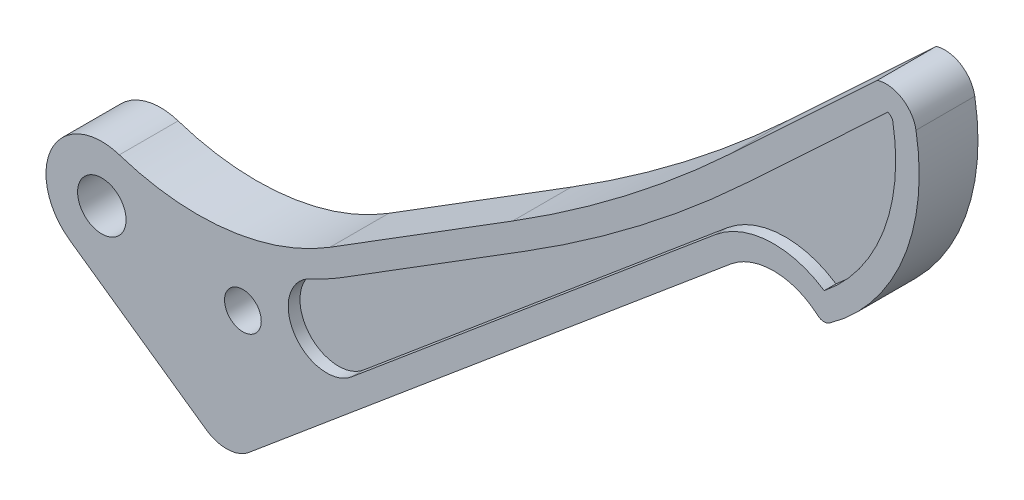
ISO-10303-21;
HEADER;
FILE_DESCRIPTION(('STEP AP214'),'2;1');
FILE_NAME('part.step','',(''),(''),'','','');
FILE_SCHEMA(('AUTOMOTIVE_DESIGN { 1 0 10303 214 1 1 1 1 }'));
ENDSEC;
DATA;
#1=APPLICATION_CONTEXT('core data for automotive mechanical design processes');
#2=APPLICATION_PROTOCOL_DEFINITION('international standard','automotive_design',2000,#1);
#3=PRODUCT_CONTEXT('',#1,'mechanical');
#4=PRODUCT('Part','Part','',(#3));
#5=PRODUCT_RELATED_PRODUCT_CATEGORY('part','',(#4));
#6=PRODUCT_DEFINITION_FORMATION('','',#4);
#7=PRODUCT_DEFINITION_CONTEXT('part definition',#1,'design');
#8=PRODUCT_DEFINITION('design','',#6,#7);
#9=PRODUCT_DEFINITION_SHAPE('','',#8);
#10=(LENGTH_UNIT() NAMED_UNIT(*) SI_UNIT(.MILLI.,.METRE.));
#11=(NAMED_UNIT(*) PLANE_ANGLE_UNIT() SI_UNIT($,.RADIAN.));
#12=(NAMED_UNIT(*) SI_UNIT($,.STERADIAN.) SOLID_ANGLE_UNIT());
#13=UNCERTAINTY_MEASURE_WITH_UNIT(LENGTH_MEASURE(1.E-05),#10,'distance_accuracy_value','');
#14=(GEOMETRIC_REPRESENTATION_CONTEXT(3) GLOBAL_UNCERTAINTY_ASSIGNED_CONTEXT((#13)) GLOBAL_UNIT_ASSIGNED_CONTEXT((#10,
#11,#12)) REPRESENTATION_CONTEXT('',''));
#15=CARTESIAN_POINT('',(0.,0.,0.));
#16=DIRECTION('',(0.,0.,1.));
#17=DIRECTION('',(1.,0.,0.));
#18=AXIS2_PLACEMENT_3D('',#15,#16,#17);
#19=CARTESIAN_POINT('',(0.,0.,0.));
#20=DIRECTION('',(0.,0.,1.));
#21=DIRECTION('',(1.,0.,0.));
#22=AXIS2_PLACEMENT_3D('',#19,#20,#21);
#23=PLANE('',#22);
#24=CARTESIAN_POINT('',(0.,0.,0.));
#25=DIRECTION('',(0.,0.,1.));
#26=DIRECTION('',(1.,0.,0.));
#27=AXIS2_PLACEMENT_3D('',#24,#25,#26);
#28=CIRCLE('',#27,6.5484375);
#29=CARTESIAN_POINT('',(6.5484375,0.,0.));
#30=VERTEX_POINT('',#29);
#31=EDGE_CURVE('E356',#30,#30,#28,.T.);
#32=ORIENTED_EDGE('',*,*,#31,.T.);
#33=EDGE_LOOP('',(#32));
#34=FACE_BOUND('',#33,.T.);
#35=CARTESIAN_POINT('',(38.1,-5.43168266689182,0.));
#36=DIRECTION('',(0.,0.,1.));
#37=DIRECTION('',(1.,0.,0.));
#38=AXIS2_PLACEMENT_3D('',#35,#36,#37);
#39=CIRCLE('',#38,4.96093749999999);
#40=CARTESIAN_POINT('',(43.0609375,-5.43168266689182,0.));
#41=VERTEX_POINT('',#40);
#42=EDGE_CURVE('E435',#41,#41,#39,.T.);
#43=ORIENTED_EDGE('',*,*,#42,.T.);
#44=EDGE_LOOP('',(#43));
#45=FACE_BOUND('',#44,.T.);
#46=DIRECTION('',(-0.731121070950227,-0.682247740643084,0.));
#47=VECTOR('',#46,1.);
#48=CARTESIAN_POINT('',(30.5942580905353,-32.7859007916915,0.));
#49=LINE('',#48,#47);
#50=CARTESIAN_POINT('',(209.442132071851,134.106509768964,0.));
#51=VERTEX_POINT('',#50);
#52=CARTESIAN_POINT('',(169.802643178431,97.1168061311885,0.));
#53=VERTEX_POINT('',#52);
#54=EDGE_CURVE('E439',#51,#53,#49,.T.);
#55=ORIENTED_EDGE('',*,*,#54,.F.);
#56=CARTESIAN_POINT('',(211.783498351615,126.229796742769,0.));
#57=DIRECTION('',(0.,0.,1.));
#58=DIRECTION('',(1.,0.,0.));
#59=AXIS2_PLACEMENT_3D('',#56,#57,#58);
#60=CIRCLE('',#59,8.21733558722366);
#61=CARTESIAN_POINT('',(219.876867622889,127.651759467968,0.));
#62=VERTEX_POINT('',#61);
#63=EDGE_CURVE('E385',#62,#51,#60,.T.);
#64=ORIENTED_EDGE('',*,*,#63,.F.);
#65=CARTESIAN_POINT('',(163.338861511694,117.718326981136,0.));
#66=DIRECTION('',(0.,0.,1.));
#67=DIRECTION('',(1.,0.,0.));
#68=AXIS2_PLACEMENT_3D('',#65,#66,#67);
#69=CIRCLE('',#68,57.404);
#70=CARTESIAN_POINT('',(196.519579075703,70.8754065134983,0.));
#71=VERTEX_POINT('',#70);
#72=EDGE_CURVE('E477',#62,#71,#69,.F.);
#73=ORIENTED_EDGE('',*,*,#72,.T.);
#74=CARTESIAN_POINT('',(195.051405732163,72.9481021094115,0.));
#75=DIRECTION('',(0.,0.,1.));
#76=DIRECTION('',(1.,0.,0.));
#77=AXIS2_PLACEMENT_3D('',#74,#75,#76);
#78=CIRCLE('',#77,2.54000000000001);
#79=CARTESIAN_POINT('',(193.375235204553,71.0396859172846,0.));
#80=VERTEX_POINT('',#79);
#81=EDGE_CURVE('E473',#71,#80,#78,.F.);
#82=ORIENTED_EDGE('',*,*,#81,.T.);
#83=CARTESIAN_POINT('',(181.432374890459,57.4420551104559,0.));
#84=DIRECTION('',(0.,0.,1.));
#85=DIRECTION('',(1.,0.,0.));
#86=AXIS2_PLACEMENT_3D('',#83,#84,#85);
#87=CIRCLE('',#86,18.0977201890399);
#88=CARTESIAN_POINT('',(169.802643178431,71.308446722806,0.));
#89=VERTEX_POINT('',#88);
#90=EDGE_CURVE('E469',#89,#80,#87,.F.);
#91=ORIENTED_EDGE('',*,*,#90,.F.);
#92=DIRECTION('',(0.766195491338607,0.64260755446259,0.));
#93=VECTOR('',#92,1.);
#94=CARTESIAN_POINT('',(35.009420797873,-41.7425226071909,0.));
#95=LINE('',#94,#93);
#96=CARTESIAN_POINT('',(39.3098375354692,-38.1357664801238,0.));
#97=VERTEX_POINT('',#96);
#98=EDGE_CURVE('E466',#97,#89,#95,.T.);
#99=ORIENTED_EDGE('',*,*,#98,.F.);
#100=CARTESIAN_POINT('',(33.68933628726,-30.4457995934019,0.));
#101=DIRECTION('',(0.,0.,1.));
#102=DIRECTION('',(1.,0.,0.));
#103=AXIS2_PLACEMENT_3D('',#100,#101,#102);
#104=CIRCLE('',#103,9.52500000000002);
#105=CARTESIAN_POINT('',(28.2156232284234,-38.2409320713988,0.));
#106=VERTEX_POINT('',#105);
#107=EDGE_CURVE('E463',#106,#97,#104,.T.);
#108=ORIENTED_EDGE('',*,*,#107,.F.);
#109=DIRECTION('',(-0.818386611863191,0.574668037673131,0.));
#110=VECTOR('',#109,1.);
#111=CARTESIAN_POINT('',(-8.66671234315792,-12.3422930901618,0.));
#112=LINE('',#111,#110);
#113=CARTESIAN_POINT('',(-8.66671234315792,-12.3422930901618,0.));
#114=VERTEX_POINT('',#113);
#115=EDGE_CURVE('E459',#106,#114,#112,.T.);
#116=ORIENTED_EDGE('',*,*,#115,.T.);
#117=CARTESIAN_POINT('',(0.,0.,0.));
#118=DIRECTION('',(0.,0.,1.));
#119=DIRECTION('',(1.,0.,0.));
#120=AXIS2_PLACEMENT_3D('',#117,#118,#119);
#121=CIRCLE('',#120,15.08125);
#122=CARTESIAN_POINT('',(4.73545493154553,14.3185043965423,0.));
#123=VERTEX_POINT('',#122);
#124=EDGE_CURVE('E455',#123,#114,#121,.T.);
#125=ORIENTED_EDGE('',*,*,#124,.F.);
#126=CARTESIAN_POINT('',(25.9011148132651,78.316704876345,0.));
#127=DIRECTION('',(0.,0.,1.));
#128=DIRECTION('',(1.,0.,0.));
#129=AXIS2_PLACEMENT_3D('',#126,#127,#128);
#130=CIRCLE('',#129,67.4073795877102);
#131=CARTESIAN_POINT('',(61.6023152897305,21.1399691578653,0.));
#132=VERTEX_POINT('',#131);
#133=EDGE_CURVE('E451',#123,#132,#130,.T.);
#134=ORIENTED_EDGE('',*,*,#133,.T.);
#135=DIRECTION('',(0.848226649191749,0.529633412466526,0.));
#136=VECTOR('',#135,1.);
#137=CARTESIAN_POINT('',(7.78304734558419,-12.464825698403,0.));
#138=LINE('',#137,#136);
#139=CARTESIAN_POINT('',(110.917160699245,51.9321989049359,0.));
#140=VERTEX_POINT('',#139);
#141=EDGE_CURVE('E447',#132,#140,#138,.T.);
#142=ORIENTED_EDGE('',*,*,#141,.T.);
#143=CARTESIAN_POINT('',(-93.4392677096838,379.216249401003,0.));
#144=DIRECTION('',(0.,0.,1.));
#145=DIRECTION('',(1.,0.,0.));
#146=AXIS2_PLACEMENT_3D('',#143,#144,#145);
#147=CIRCLE('',#146,385.845046023874);
#148=EDGE_CURVE('E443',#53,#140,#147,.F.);
#149=ORIENTED_EDGE('',*,*,#148,.F.);
#150=EDGE_LOOP('',(#55,#64,#73,#82,#91,#99,#108,#116,#125,#134,#142,#149));
#151=FACE_BOUND('',#150,.T.);
#152=CARTESIAN_POINT('',(25.9011148132651,78.316704876345,0.));
#153=DIRECTION('',(0.,0.,1.));
#154=DIRECTION('',(-1.,0.,0.));
#155=AXIS2_PLACEMENT_3D('',#152,#153,#154);
#156=CIRCLE('',#155,73.7573795877102);
#157=CARTESIAN_POINT('',(56.4349340766916,11.1762779724746,0.));
#158=VERTEX_POINT('',#157);
#159=CARTESIAN_POINT('',(64.965487458893,15.7537299354977,0.));
#160=VERTEX_POINT('',#159);
#161=EDGE_CURVE('E320',#158,#160,#156,.T.);
#162=ORIENTED_EDGE('',*,*,#161,.F.);
#163=CARTESIAN_POINT('',(60.7419191292175,1.7057033090044,0.));
#164=DIRECTION('',(0.,0.,-1.));
#165=DIRECTION('',(1.,0.,0.));
#166=AXIS2_PLACEMENT_3D('',#163,#164,#165);
#167=CIRCLE('',#166,10.4039369807321);
#168=CARTESIAN_POINT('',(67.4275676291886,-6.2657462978035,0.));
#169=VERTEX_POINT('',#168);
#170=EDGE_CURVE('E288',#169,#158,#167,.T.);
#171=ORIENTED_EDGE('',*,*,#170,.F.);
#172=DIRECTION('',(-0.766195491338607,-0.642607554462591,0.));
#173=VECTOR('',#172,1.);
#174=CARTESIAN_POINT('',(165.722085207594,76.1737880928061,0.));
#175=LINE('',#174,#173);
#176=CARTESIAN_POINT('',(165.722085207594,76.1737880928061,0.));
#177=VERTEX_POINT('',#176);
#178=EDGE_CURVE('E347',#177,#169,#175,.T.);
#179=ORIENTED_EDGE('',*,*,#178,.F.);
#180=CARTESIAN_POINT('',(181.432374890459,57.4420551104559,0.));
#181=DIRECTION('',(0.,0.,1.));
#182=DIRECTION('',(-1.,0.,0.));
#183=AXIS2_PLACEMENT_3D('',#180,#181,#182);
#184=CIRCLE('',#183,24.4477201890399);
#185=CARTESIAN_POINT('',(195.076715953464,77.7280842782842,0.));
#186=VERTEX_POINT('',#185);
#187=EDGE_CURVE('E343',#186,#177,#184,.T.);
#188=ORIENTED_EDGE('',*,*,#187,.F.);
#189=CARTESIAN_POINT('',(163.338861511694,117.718326981136,0.));
#190=DIRECTION('',(0.,0.,-1.));
#191=DIRECTION('',(-1.,0.,0.));
#192=AXIS2_PLACEMENT_3D('',#189,#190,#191);
#193=CIRCLE('',#192,51.054);
#194=CARTESIAN_POINT('',(213.622663407049,126.552928440664,0.));
#195=VERTEX_POINT('',#194);
#196=EDGE_CURVE('E339',#195,#186,#193,.T.);
#197=ORIENTED_EDGE('',*,*,#196,.F.);
#198=CARTESIAN_POINT('',(211.783498351615,126.229796742769,0.));
#199=DIRECTION('',(0.,0.,-1.));
#200=DIRECTION('',(-1.,0.,0.));
#201=AXIS2_PLACEMENT_3D('',#198,#199,#200);
#202=CIRCLE('',#201,1.86733558722366);
#203=CARTESIAN_POINT('',(212.247088608111,128.038671052773,0.));
#204=VERTEX_POINT('',#203);
#205=EDGE_CURVE('E335',#204,#195,#202,.T.);
#206=ORIENTED_EDGE('',*,*,#205,.F.);
#207=DIRECTION('',(0.731121070950227,0.682247740643084,0.));
#208=VECTOR('',#207,1.);
#209=CARTESIAN_POINT('',(174.134916331515,92.4741873306545,0.));
#210=LINE('',#209,#208);
#211=CARTESIAN_POINT('',(174.134916331515,92.4741873306545,0.));
#212=VERTEX_POINT('',#211);
#213=EDGE_CURVE('E331',#212,#204,#210,.T.);
#214=ORIENTED_EDGE('',*,*,#213,.F.);
#215=CARTESIAN_POINT('',(-93.4392677096838,379.216249401003,0.));
#216=DIRECTION('',(0.,0.,1.));
#217=DIRECTION('',(-1.,0.,0.));
#218=AXIS2_PLACEMENT_3D('',#215,#216,#217);
#219=CIRCLE('',#218,392.195046023874);
#220=CARTESIAN_POINT('',(114.280332868407,46.5459596825684,0.));
#221=VERTEX_POINT('',#220);
#222=EDGE_CURVE('E327',#221,#212,#219,.T.);
#223=ORIENTED_EDGE('',*,*,#222,.F.);
#224=DIRECTION('',(0.848226649191749,0.529633412466526,0.));
#225=VECTOR('',#224,1.);
#226=CARTESIAN_POINT('',(64.965487458893,15.7537299354977,0.));
#227=LINE('',#226,#225);
#228=EDGE_CURVE('E323',#160,#221,#227,.T.);
#229=ORIENTED_EDGE('',*,*,#228,.F.);
#230=EDGE_LOOP('',(#162,#171,#179,#188,#197,#206,#214,#223,#229));
#231=FACE_BOUND('',#230,.T.);
#232=ADVANCED_FACE('F49',(#34,#45,#151,#231),#23,.F.);
#233=CARTESIAN_POINT('',(30.5942580905353,-32.7859007916915,15.875));
#234=DIRECTION('',(0.682247740643084,-0.731121070950227,0.));
#235=DIRECTION('',(0.731121070950227,0.682247740643084,0.));
#236=AXIS2_PLACEMENT_3D('',#233,#234,#235);
#237=PLANE('',#236);
#238=ORIENTED_EDGE('',*,*,#54,.T.);
#239=DIRECTION('',(0.,0.,-1.));
#240=VECTOR('',#239,1.);
#241=CARTESIAN_POINT('',(169.802643178431,97.1168061311885,15.875));
#242=LINE('',#241,#240);
#243=CARTESIAN_POINT('',(169.802643178431,97.1168061311885,15.875));
#244=VERTEX_POINT('',#243);
#245=EDGE_CURVE('E11',#244,#53,#242,.T.);
#246=ORIENTED_EDGE('',*,*,#245,.F.);
#247=DIRECTION('',(-0.731121070950227,-0.682247740643084,0.));
#248=VECTOR('',#247,1.);
#249=CARTESIAN_POINT('',(30.5942580905353,-32.7859007916915,15.875));
#250=LINE('',#249,#248);
#251=CARTESIAN_POINT('',(209.442132071851,134.106509768964,15.875));
#252=VERTEX_POINT('',#251);
#253=EDGE_CURVE('E389',#252,#244,#250,.T.);
#254=ORIENTED_EDGE('',*,*,#253,.F.);
#255=DIRECTION('',(0.,0.,-1.));
#256=VECTOR('',#255,1.);
#257=CARTESIAN_POINT('',(209.442132071851,134.106509768964,15.875));
#258=LINE('',#257,#256);
#259=EDGE_CURVE('E431',#252,#51,#258,.T.);
#260=ORIENTED_EDGE('',*,*,#259,.T.);
#261=EDGE_LOOP('',(#238,#246,#254,#260));
#262=FACE_BOUND('',#261,.T.);
#263=ADVANCED_FACE('F539',(#262),#237,.F.);
#264=CARTESIAN_POINT('',(-93.4392677096838,379.216249401003,15.875));
#265=DIRECTION('',(0.,0.,-1.));
#266=DIRECTION('',(-1.,0.,0.));
#267=AXIS2_PLACEMENT_3D('',#264,#265,#266);
#268=CYLINDRICAL_SURFACE('',#267,385.845046023874);
#269=ORIENTED_EDGE('',*,*,#148,.T.);
#270=DIRECTION('',(0.,0.,-1.));
#271=VECTOR('',#270,1.);
#272=CARTESIAN_POINT('',(110.917160699245,51.9321989049359,15.875));
#273=LINE('',#272,#271);
#274=CARTESIAN_POINT('',(110.917160699245,51.9321989049359,15.875));
#275=VERTEX_POINT('',#274);
#276=EDGE_CURVE('E58',#275,#140,#273,.T.);
#277=ORIENTED_EDGE('',*,*,#276,.F.);
#278=CARTESIAN_POINT('',(-93.4392677096838,379.216249401003,15.875));
#279=DIRECTION('',(0.,0.,1.));
#280=DIRECTION('',(1.,0.,0.));
#281=AXIS2_PLACEMENT_3D('',#278,#279,#280);
#282=CIRCLE('',#281,385.845046023874);
#283=EDGE_CURVE('E393',#244,#275,#282,.F.);
#284=ORIENTED_EDGE('',*,*,#283,.F.);
#285=ORIENTED_EDGE('',*,*,#245,.T.);
#286=EDGE_LOOP('',(#269,#277,#284,#285));
#287=FACE_BOUND('',#286,.T.);
#288=ADVANCED_FACE('F521',(#287),#268,.F.);
#289=CARTESIAN_POINT('',(7.78304734558419,-12.464825698403,15.875));
#290=DIRECTION('',(-0.529633412466526,0.848226649191749,0.));
#291=DIRECTION('',(-0.848226649191749,-0.529633412466526,0.));
#292=AXIS2_PLACEMENT_3D('',#289,#290,#291);
#293=PLANE('',#292);
#294=ORIENTED_EDGE('',*,*,#141,.F.);
#295=DIRECTION('',(0.,0.,-1.));
#296=VECTOR('',#295,1.);
#297=CARTESIAN_POINT('',(61.6023152897305,21.1399691578653,15.875));
#298=LINE('',#297,#296);
#299=CARTESIAN_POINT('',(61.6023152897305,21.1399691578653,15.875));
#300=VERTEX_POINT('',#299);
#301=EDGE_CURVE('E512',#300,#132,#298,.T.);
#302=ORIENTED_EDGE('',*,*,#301,.F.);
#303=DIRECTION('',(0.848226649191749,0.529633412466526,0.));
#304=VECTOR('',#303,1.);
#305=CARTESIAN_POINT('',(7.78304734558419,-12.464825698403,15.875));
#306=LINE('',#305,#304);
#307=EDGE_CURVE('E396',#300,#275,#306,.T.);
#308=ORIENTED_EDGE('',*,*,#307,.T.);
#309=ORIENTED_EDGE('',*,*,#276,.T.);
#310=EDGE_LOOP('',(#294,#302,#308,#309));
#311=FACE_BOUND('',#310,.T.);
#312=ADVANCED_FACE('F518',(#311),#293,.T.);
#313=CARTESIAN_POINT('',(25.9011148132651,78.316704876345,15.875));
#314=DIRECTION('',(0.,0.,-1.));
#315=DIRECTION('',(-1.,0.,0.));
#316=AXIS2_PLACEMENT_3D('',#313,#314,#315);
#317=CYLINDRICAL_SURFACE('',#316,67.4073795877102);
#318=ORIENTED_EDGE('',*,*,#133,.F.);
#319=DIRECTION('',(0.,0.,-1.));
#320=VECTOR('',#319,1.);
#321=CARTESIAN_POINT('',(4.73545493154553,14.3185043965423,15.875));
#322=LINE('',#321,#320);
#323=CARTESIAN_POINT('',(4.73545493154553,14.3185043965423,15.875));
#324=VERTEX_POINT('',#323);
#325=EDGE_CURVE('E509',#324,#123,#322,.T.);
#326=ORIENTED_EDGE('',*,*,#325,.F.);
#327=CARTESIAN_POINT('',(25.9011148132651,78.316704876345,15.875));
#328=DIRECTION('',(0.,0.,1.));
#329=DIRECTION('',(1.,0.,0.));
#330=AXIS2_PLACEMENT_3D('',#327,#328,#329);
#331=CIRCLE('',#330,67.4073795877102);
#332=EDGE_CURVE('E400',#324,#300,#331,.T.);
#333=ORIENTED_EDGE('',*,*,#332,.T.);
#334=ORIENTED_EDGE('',*,*,#301,.T.);
#335=EDGE_LOOP('',(#318,#326,#333,#334));
#336=FACE_BOUND('',#335,.T.);
#337=ADVANCED_FACE('F529',(#336),#317,.F.);
#338=CARTESIAN_POINT('',(0.,0.,15.875));
#339=DIRECTION('',(0.,0.,-1.));
#340=DIRECTION('',(-1.,0.,0.));
#341=AXIS2_PLACEMENT_3D('',#338,#339,#340);
#342=CYLINDRICAL_SURFACE('',#341,15.08125);
#343=ORIENTED_EDGE('',*,*,#124,.T.);
#344=DIRECTION('',(0.,0.,-1.));
#345=VECTOR('',#344,1.);
#346=CARTESIAN_POINT('',(-8.66671234315792,-12.3422930901618,15.875));
#347=LINE('',#346,#345);
#348=CARTESIAN_POINT('',(-8.66671234315792,-12.3422930901618,15.875));
#349=VERTEX_POINT('',#348);
#350=EDGE_CURVE('E506',#349,#114,#347,.T.);
#351=ORIENTED_EDGE('',*,*,#350,.F.);
#352=CARTESIAN_POINT('',(0.,0.,15.875));
#353=DIRECTION('',(0.,0.,1.));
#354=DIRECTION('',(1.,0.,0.));
#355=AXIS2_PLACEMENT_3D('',#352,#353,#354);
#356=CIRCLE('',#355,15.08125);
#357=EDGE_CURVE('E404',#324,#349,#356,.T.);
#358=ORIENTED_EDGE('',*,*,#357,.F.);
#359=ORIENTED_EDGE('',*,*,#325,.T.);
#360=EDGE_LOOP('',(#343,#351,#358,#359));
#361=FACE_BOUND('',#360,.T.);
#362=ADVANCED_FACE('F570',(#361),#342,.T.);
#363=CARTESIAN_POINT('',(-8.66671234315792,-12.3422930901618,15.875));
#364=DIRECTION('',(-0.574668037673131,-0.818386611863191,0.));
#365=DIRECTION('',(0.818386611863191,-0.574668037673131,0.));
#366=AXIS2_PLACEMENT_3D('',#363,#364,#365);
#367=PLANE('',#366);
#368=ORIENTED_EDGE('',*,*,#115,.F.);
#369=DIRECTION('',(0.,0.,-1.));
#370=VECTOR('',#369,1.);
#371=CARTESIAN_POINT('',(28.2156232284234,-38.2409320713988,15.875));
#372=LINE('',#371,#370);
#373=CARTESIAN_POINT('',(28.2156232284234,-38.2409320713988,15.875));
#374=VERTEX_POINT('',#373);
#375=EDGE_CURVE('E503',#374,#106,#372,.T.);
#376=ORIENTED_EDGE('',*,*,#375,.F.);
#377=DIRECTION('',(-0.818386611863191,0.574668037673131,0.));
#378=VECTOR('',#377,1.);
#379=CARTESIAN_POINT('',(-8.66671234315792,-12.3422930901618,15.875));
#380=LINE('',#379,#378);
#381=EDGE_CURVE('E407',#374,#349,#380,.T.);
#382=ORIENTED_EDGE('',*,*,#381,.T.);
#383=ORIENTED_EDGE('',*,*,#350,.T.);
#384=EDGE_LOOP('',(#368,#376,#382,#383));
#385=FACE_BOUND('',#384,.T.);
#386=ADVANCED_FACE('F567',(#385),#367,.T.);
#387=CARTESIAN_POINT('',(33.68933628726,-30.4457995934019,15.875));
#388=DIRECTION('',(0.,0.,-1.));
#389=DIRECTION('',(-1.,0.,0.));
#390=AXIS2_PLACEMENT_3D('',#387,#388,#389);
#391=CYLINDRICAL_SURFACE('',#390,9.52500000000002);
#392=ORIENTED_EDGE('',*,*,#107,.T.);
#393=DIRECTION('',(0.,0.,-1.));
#394=VECTOR('',#393,1.);
#395=CARTESIAN_POINT('',(39.3098375354692,-38.1357664801238,15.875));
#396=LINE('',#395,#394);
#397=CARTESIAN_POINT('',(39.3098375354692,-38.1357664801238,15.875));
#398=VERTEX_POINT('',#397);
#399=EDGE_CURVE('E499',#398,#97,#396,.T.);
#400=ORIENTED_EDGE('',*,*,#399,.F.);
#401=CARTESIAN_POINT('',(33.68933628726,-30.4457995934019,15.875));
#402=DIRECTION('',(0.,0.,1.));
#403=DIRECTION('',(1.,0.,0.));
#404=AXIS2_PLACEMENT_3D('',#401,#402,#403);
#405=CIRCLE('',#404,9.52500000000002);
#406=EDGE_CURVE('E411',#374,#398,#405,.T.);
#407=ORIENTED_EDGE('',*,*,#406,.F.);
#408=ORIENTED_EDGE('',*,*,#375,.T.);
#409=EDGE_LOOP('',(#392,#400,#407,#408));
#410=FACE_BOUND('',#409,.T.);
#411=ADVANCED_FACE('F563',(#410),#391,.T.);
#412=CARTESIAN_POINT('',(35.009420797873,-41.7425226071909,15.875));
#413=DIRECTION('',(-0.64260755446259,0.766195491338607,0.));
#414=DIRECTION('',(-0.766195491338607,-0.64260755446259,0.));
#415=AXIS2_PLACEMENT_3D('',#412,#413,#414);
#416=PLANE('',#415);
#417=ORIENTED_EDGE('',*,*,#98,.T.);
#418=DIRECTION('',(0.,0.,-1.));
#419=VECTOR('',#418,1.);
#420=CARTESIAN_POINT('',(169.802643178431,71.308446722806,15.875));
#421=LINE('',#420,#419);
#422=CARTESIAN_POINT('',(169.802643178431,71.308446722806,15.875));
#423=VERTEX_POINT('',#422);
#424=EDGE_CURVE('E495',#423,#89,#421,.T.);
#425=ORIENTED_EDGE('',*,*,#424,.F.);
#426=DIRECTION('',(0.766195491338607,0.64260755446259,0.));
#427=VECTOR('',#426,1.);
#428=CARTESIAN_POINT('',(35.009420797873,-41.7425226071909,15.875));
#429=LINE('',#428,#427);
#430=EDGE_CURVE('E414',#398,#423,#429,.T.);
#431=ORIENTED_EDGE('',*,*,#430,.F.);
#432=ORIENTED_EDGE('',*,*,#399,.T.);
#433=EDGE_LOOP('',(#417,#425,#431,#432));
#434=FACE_BOUND('',#433,.T.);
#435=ADVANCED_FACE('F559',(#434),#416,.F.);
#436=CARTESIAN_POINT('',(181.432374890459,57.4420551104559,15.875));
#437=DIRECTION('',(0.,0.,-1.));
#438=DIRECTION('',(-1.,0.,0.));
#439=AXIS2_PLACEMENT_3D('',#436,#437,#438);
#440=CYLINDRICAL_SURFACE('',#439,18.0977201890399);
#441=ORIENTED_EDGE('',*,*,#90,.T.);
#442=DIRECTION('',(0.,0.,-1.));
#443=VECTOR('',#442,1.);
#444=CARTESIAN_POINT('',(193.375235204553,71.0396859172846,15.875));
#445=LINE('',#444,#443);
#446=CARTESIAN_POINT('',(193.375235204553,71.0396859172846,15.875));
#447=VERTEX_POINT('',#446);
#448=EDGE_CURVE('E492',#447,#80,#445,.T.);
#449=ORIENTED_EDGE('',*,*,#448,.F.);
#450=CARTESIAN_POINT('',(181.432374890459,57.4420551104559,15.875));
#451=DIRECTION('',(0.,0.,1.));
#452=DIRECTION('',(1.,0.,0.));
#453=AXIS2_PLACEMENT_3D('',#450,#451,#452);
#454=CIRCLE('',#453,18.0977201890399);
#455=EDGE_CURVE('E417',#423,#447,#454,.F.);
#456=ORIENTED_EDGE('',*,*,#455,.F.);
#457=ORIENTED_EDGE('',*,*,#424,.T.);
#458=EDGE_LOOP('',(#441,#449,#456,#457));
#459=FACE_BOUND('',#458,.T.);
#460=ADVANCED_FACE('F554',(#459),#440,.F.);
#461=CARTESIAN_POINT('',(195.051405732163,72.9481021094115,15.875));
#462=DIRECTION('',(0.,0.,-1.));
#463=DIRECTION('',(-1.,0.,0.));
#464=AXIS2_PLACEMENT_3D('',#461,#462,#463);
#465=CYLINDRICAL_SURFACE('',#464,2.54000000000001);
#466=ORIENTED_EDGE('',*,*,#81,.F.);
#467=DIRECTION('',(0.,0.,-1.));
#468=VECTOR('',#467,1.);
#469=CARTESIAN_POINT('',(196.519579075703,70.8754065134983,15.875));
#470=LINE('',#469,#468);
#471=CARTESIAN_POINT('',(196.519579075703,70.8754065134983,15.875));
#472=VERTEX_POINT('',#471);
#473=EDGE_CURVE('E489',#472,#71,#470,.T.);
#474=ORIENTED_EDGE('',*,*,#473,.F.);
#475=CARTESIAN_POINT('',(195.051405732163,72.9481021094115,15.875));
#476=DIRECTION('',(0.,0.,1.));
#477=DIRECTION('',(1.,0.,0.));
#478=AXIS2_PLACEMENT_3D('',#475,#476,#477);
#479=CIRCLE('',#478,2.54000000000001);
#480=EDGE_CURVE('E420',#472,#447,#479,.F.);
#481=ORIENTED_EDGE('',*,*,#480,.T.);
#482=ORIENTED_EDGE('',*,*,#448,.T.);
#483=EDGE_LOOP('',(#466,#474,#481,#482));
#484=FACE_BOUND('',#483,.T.);
#485=ADVANCED_FACE('F548',(#484),#465,.T.);
#486=CARTESIAN_POINT('',(163.338861511694,117.718326981136,15.875));
#487=DIRECTION('',(0.,0.,-1.));
#488=DIRECTION('',(-1.,0.,0.));
#489=AXIS2_PLACEMENT_3D('',#486,#487,#488);
#490=CYLINDRICAL_SURFACE('',#489,57.404);
#491=ORIENTED_EDGE('',*,*,#72,.F.);
#492=DIRECTION('',(0.,0.,-1.));
#493=VECTOR('',#492,1.);
#494=CARTESIAN_POINT('',(219.876867622889,127.651759467968,15.875));
#495=LINE('',#494,#493);
#496=CARTESIAN_POINT('',(219.876867622889,127.651759467968,15.875));
#497=VERTEX_POINT('',#496);
#498=EDGE_CURVE('E486',#497,#62,#495,.T.);
#499=ORIENTED_EDGE('',*,*,#498,.F.);
#500=CARTESIAN_POINT('',(163.338861511694,117.718326981136,15.875));
#501=DIRECTION('',(0.,0.,1.));
#502=DIRECTION('',(1.,0.,0.));
#503=AXIS2_PLACEMENT_3D('',#500,#501,#502);
#504=CIRCLE('',#503,57.404);
#505=EDGE_CURVE('E424',#497,#472,#504,.F.);
#506=ORIENTED_EDGE('',*,*,#505,.T.);
#507=ORIENTED_EDGE('',*,*,#473,.T.);
#508=EDGE_LOOP('',(#491,#499,#506,#507));
#509=FACE_BOUND('',#508,.T.);
#510=ADVANCED_FACE('F544',(#509),#490,.T.);
#511=CARTESIAN_POINT('',(38.1,-5.43168266689182,15.875));
#512=DIRECTION('',(0.,0.,-1.));
#513=DIRECTION('',(-1.,0.,0.));
#514=AXIS2_PLACEMENT_3D('',#511,#512,#513);
#515=CYLINDRICAL_SURFACE('',#514,4.96093749999999);
#516=CARTESIAN_POINT('',(38.1,-5.43168266689182,15.875));
#517=DIRECTION('',(0.,0.,1.));
#518=DIRECTION('',(1.,0.,0.));
#519=AXIS2_PLACEMENT_3D('',#516,#517,#518);
#520=CIRCLE('',#519,4.96093749999999);
#521=CARTESIAN_POINT('',(43.0609375,-5.43168266689182,15.875));
#522=VERTEX_POINT('',#521);
#523=EDGE_CURVE('E384',#522,#522,#520,.T.);
#524=ORIENTED_EDGE('',*,*,#523,.T.);
#525=EDGE_LOOP('',(#524));
#526=FACE_BOUND('',#525,.T.);
#527=ORIENTED_EDGE('',*,*,#42,.F.);
#528=EDGE_LOOP('',(#527));
#529=FACE_BOUND('',#528,.T.);
#530=ADVANCED_FACE('F596',(#526,#529),#515,.F.);
#531=CARTESIAN_POINT('',(0.,0.,15.875));
#532=DIRECTION('',(0.,0.,-1.));
#533=DIRECTION('',(-1.,0.,0.));
#534=AXIS2_PLACEMENT_3D('',#531,#532,#533);
#535=CYLINDRICAL_SURFACE('',#534,6.5484375);
#536=CARTESIAN_POINT('',(0.,0.,15.875));
#537=DIRECTION('',(0.,0.,1.));
#538=DIRECTION('',(1.,0.,0.));
#539=AXIS2_PLACEMENT_3D('',#536,#537,#538);
#540=CIRCLE('',#539,6.5484375);
#541=CARTESIAN_POINT('',(6.5484375,0.,15.875));
#542=VERTEX_POINT('',#541);
#543=EDGE_CURVE('E380',#542,#542,#540,.T.);
#544=ORIENTED_EDGE('',*,*,#543,.T.);
#545=EDGE_LOOP('',(#544));
#546=FACE_BOUND('',#545,.T.);
#547=ORIENTED_EDGE('',*,*,#31,.F.);
#548=EDGE_LOOP('',(#547));
#549=FACE_BOUND('',#548,.T.);
#550=ADVANCED_FACE('F51',(#546,#549),#535,.F.);
#551=CARTESIAN_POINT('',(211.783498351615,126.229796742769,15.875));
#552=DIRECTION('',(0.,0.,-1.));
#553=DIRECTION('',(-1.,0.,0.));
#554=AXIS2_PLACEMENT_3D('',#551,#552,#553);
#555=CYLINDRICAL_SURFACE('',#554,8.21733558722366);
#556=ORIENTED_EDGE('',*,*,#63,.T.);
#557=ORIENTED_EDGE('',*,*,#259,.F.);
#558=CARTESIAN_POINT('',(211.783498351615,126.229796742769,15.875));
#559=DIRECTION('',(0.,0.,1.));
#560=DIRECTION('',(1.,0.,0.));
#561=AXIS2_PLACEMENT_3D('',#558,#559,#560);
#562=CIRCLE('',#561,8.21733558722366);
#563=EDGE_CURVE('E428',#497,#252,#562,.T.);
#564=ORIENTED_EDGE('',*,*,#563,.F.);
#565=ORIENTED_EDGE('',*,*,#498,.T.);
#566=EDGE_LOOP('',(#556,#557,#564,#565));
#567=FACE_BOUND('',#566,.T.);
#568=ADVANCED_FACE('F592',(#567),#555,.T.);
#569=CARTESIAN_POINT('',(0.,0.,15.875));
#570=DIRECTION('',(0.,0.,1.));
#571=DIRECTION('',(1.,0.,0.));
#572=AXIS2_PLACEMENT_3D('',#569,#570,#571);
#573=PLANE('',#572);
#574=CARTESIAN_POINT('',(60.7419191292175,1.7057033090044,15.875));
#575=DIRECTION('',(0.,0.,-1.));
#576=DIRECTION('',(1.,0.,0.));
#577=AXIS2_PLACEMENT_3D('',#574,#575,#576);
#578=CIRCLE('',#577,10.4039369807321);
#579=CARTESIAN_POINT('',(67.4275676291886,-6.2657462978035,15.875));
#580=VERTEX_POINT('',#579);
#581=CARTESIAN_POINT('',(56.4349340766916,11.1762779724745,15.875));
#582=VERTEX_POINT('',#581);
#583=EDGE_CURVE('E271',#580,#582,#578,.T.);
#584=ORIENTED_EDGE('',*,*,#583,.T.);
#585=CARTESIAN_POINT('',(25.9011148132651,78.316704876345,15.875));
#586=DIRECTION('',(0.,0.,1.));
#587=DIRECTION('',(-1.,0.,0.));
#588=AXIS2_PLACEMENT_3D('',#585,#586,#587);
#589=CIRCLE('',#588,73.7573795877102);
#590=CARTESIAN_POINT('',(64.965487458893,15.7537299354977,15.875));
#591=VERTEX_POINT('',#590);
#592=EDGE_CURVE('E258',#582,#591,#589,.T.);
#593=ORIENTED_EDGE('',*,*,#592,.T.);
#594=DIRECTION('',(0.848226649191749,0.529633412466526,0.));
#595=VECTOR('',#594,1.);
#596=CARTESIAN_POINT('',(64.965487458893,15.7537299354977,15.875));
#597=LINE('',#596,#595);
#598=CARTESIAN_POINT('',(114.280332868407,46.5459596825684,15.875));
#599=VERTEX_POINT('',#598);
#600=EDGE_CURVE('E889',#591,#599,#597,.T.);
#601=ORIENTED_EDGE('',*,*,#600,.T.);
#602=CARTESIAN_POINT('',(-93.4392677096838,379.216249401003,15.875));
#603=DIRECTION('',(0.,0.,1.));
#604=DIRECTION('',(-1.,0.,0.));
#605=AXIS2_PLACEMENT_3D('',#602,#603,#604);
#606=CIRCLE('',#605,392.195046023874);
#607=CARTESIAN_POINT('',(174.134916331515,92.4741873306545,15.875));
#608=VERTEX_POINT('',#607);
#609=EDGE_CURVE('E885',#599,#608,#606,.T.);
#610=ORIENTED_EDGE('',*,*,#609,.T.);
#611=DIRECTION('',(0.731121070950227,0.682247740643084,0.));
#612=VECTOR('',#611,1.);
#613=CARTESIAN_POINT('',(174.134916331515,92.4741873306545,15.875));
#614=LINE('',#613,#612);
#615=CARTESIAN_POINT('',(212.247088608111,128.038671052773,15.875));
#616=VERTEX_POINT('',#615);
#617=EDGE_CURVE('E879',#608,#616,#614,.T.);
#618=ORIENTED_EDGE('',*,*,#617,.T.);
#619=CARTESIAN_POINT('',(211.783498351615,126.229796742769,15.875));
#620=DIRECTION('',(0.,0.,-1.));
#621=DIRECTION('',(-1.,0.,0.));
#622=AXIS2_PLACEMENT_3D('',#619,#620,#621);
#623=CIRCLE('',#622,1.86733558722366);
#624=CARTESIAN_POINT('',(213.622663407049,126.552928440664,15.875));
#625=VERTEX_POINT('',#624);
#626=EDGE_CURVE('E874',#616,#625,#623,.T.);
#627=ORIENTED_EDGE('',*,*,#626,.T.);
#628=CARTESIAN_POINT('',(163.338861511694,117.718326981136,15.875));
#629=DIRECTION('',(0.,0.,-1.));
#630=DIRECTION('',(-1.,0.,0.));
#631=AXIS2_PLACEMENT_3D('',#628,#629,#630);
#632=CIRCLE('',#631,51.054);
#633=CARTESIAN_POINT('',(195.076715953464,77.7280842782842,15.875));
#634=VERTEX_POINT('',#633);
#635=EDGE_CURVE('E866',#625,#634,#632,.T.);
#636=ORIENTED_EDGE('',*,*,#635,.T.);
#637=CARTESIAN_POINT('',(181.432374890459,57.4420551104559,15.875));
#638=DIRECTION('',(0.,0.,1.));
#639=DIRECTION('',(-1.,0.,0.));
#640=AXIS2_PLACEMENT_3D('',#637,#638,#639);
#641=CIRCLE('',#640,24.4477201890399);
#642=CARTESIAN_POINT('',(165.722085207594,76.1737880928061,15.875));
#643=VERTEX_POINT('',#642);
#644=EDGE_CURVE('E863',#634,#643,#641,.T.);
#645=ORIENTED_EDGE('',*,*,#644,.T.);
#646=DIRECTION('',(-0.766195491338607,-0.642607554462591,0.));
#647=VECTOR('',#646,1.);
#648=CARTESIAN_POINT('',(165.722085207594,76.1737880928061,15.875));
#649=LINE('',#648,#647);
#650=EDGE_CURVE('E867',#643,#580,#649,.T.);
#651=ORIENTED_EDGE('',*,*,#650,.T.);
#652=EDGE_LOOP('',(#584,#593,#601,#610,#618,#627,#636,#645,#651));
#653=FACE_BOUND('',#652,.T.);
#654=ORIENTED_EDGE('',*,*,#543,.F.);
#655=EDGE_LOOP('',(#654));
#656=FACE_BOUND('',#655,.T.);
#657=ORIENTED_EDGE('',*,*,#523,.F.);
#658=EDGE_LOOP('',(#657));
#659=FACE_BOUND('',#658,.T.);
#660=ORIENTED_EDGE('',*,*,#253,.T.);
#661=ORIENTED_EDGE('',*,*,#283,.T.);
#662=ORIENTED_EDGE('',*,*,#307,.F.);
#663=ORIENTED_EDGE('',*,*,#332,.F.);
#664=ORIENTED_EDGE('',*,*,#357,.T.);
#665=ORIENTED_EDGE('',*,*,#381,.F.);
#666=ORIENTED_EDGE('',*,*,#406,.T.);
#667=ORIENTED_EDGE('',*,*,#430,.T.);
#668=ORIENTED_EDGE('',*,*,#455,.T.);
#669=ORIENTED_EDGE('',*,*,#480,.F.);
#670=ORIENTED_EDGE('',*,*,#505,.F.);
#671=ORIENTED_EDGE('',*,*,#563,.T.);
#672=EDGE_LOOP('',(#660,#661,#662,#663,#664,#665,#666,#667,#668,#669,#670,#671));
#673=FACE_BOUND('',#672,.T.);
#674=ADVANCED_FACE('F533',(#653,#656,#659,#673),#573,.T.);
#675=CARTESIAN_POINT('',(60.7419191292175,1.7057033090044,3.175));
#676=DIRECTION('',(0.,0.,-1.));
#677=DIRECTION('',(-1.,0.,0.));
#678=AXIS2_PLACEMENT_3D('',#675,#676,#677);
#679=CYLINDRICAL_SURFACE('',#678,10.4039369807321);
#680=ORIENTED_EDGE('',*,*,#170,.T.);
#681=DIRECTION('',(0.,0.,-1.));
#682=VECTOR('',#681,1.);
#683=CARTESIAN_POINT('',(56.4349340766916,11.1762779724746,3.175));
#684=LINE('',#683,#682);
#685=CARTESIAN_POINT('',(56.4349340766916,11.1762779724746,3.175));
#686=VERTEX_POINT('',#685);
#687=EDGE_CURVE('E73',#686,#158,#684,.T.);
#688=ORIENTED_EDGE('',*,*,#687,.F.);
#689=CARTESIAN_POINT('',(60.7419191292175,1.7057033090044,3.175));
#690=DIRECTION('',(0.,0.,-1.));
#691=DIRECTION('',(1.,0.,0.));
#692=AXIS2_PLACEMENT_3D('',#689,#690,#691);
#693=CIRCLE('',#692,10.4039369807321);
#694=CARTESIAN_POINT('',(67.4275676291886,-6.2657462978035,3.175));
#695=VERTEX_POINT('',#694);
#696=EDGE_CURVE('E283',#695,#686,#693,.T.);
#697=ORIENTED_EDGE('',*,*,#696,.F.);
#698=DIRECTION('',(0.,0.,-1.));
#699=VECTOR('',#698,1.);
#700=CARTESIAN_POINT('',(67.4275676291886,-6.2657462978035,3.175));
#701=LINE('',#700,#699);
#702=EDGE_CURVE('E353',#695,#169,#701,.T.);
#703=ORIENTED_EDGE('',*,*,#702,.T.);
#704=EDGE_LOOP('',(#680,#688,#697,#703));
#705=FACE_BOUND('',#704,.T.);
#706=ADVANCED_FACE('F657',(#705),#679,.F.);
#707=CARTESIAN_POINT('',(165.722085207594,76.1737880928061,3.175));
#708=DIRECTION('',(0.642607554462591,-0.766195491338607,0.));
#709=DIRECTION('',(0.766195491338607,0.642607554462591,0.));
#710=AXIS2_PLACEMENT_3D('',#707,#708,#709);
#711=PLANE('',#710);
#712=ORIENTED_EDGE('',*,*,#178,.T.);
#713=ORIENTED_EDGE('',*,*,#702,.F.);
#714=DIRECTION('',(-0.766195491338607,-0.642607554462591,0.));
#715=VECTOR('',#714,1.);
#716=CARTESIAN_POINT('',(165.722085207594,76.1737880928061,3.175));
#717=LINE('',#716,#715);
#718=CARTESIAN_POINT('',(165.722085207594,76.1737880928061,3.175));
#719=VERTEX_POINT('',#718);
#720=EDGE_CURVE('E316',#719,#695,#717,.T.);
#721=ORIENTED_EDGE('',*,*,#720,.F.);
#722=DIRECTION('',(0.,0.,-1.));
#723=VECTOR('',#722,1.);
#724=CARTESIAN_POINT('',(165.722085207594,76.1737880928061,3.175));
#725=LINE('',#724,#723);
#726=EDGE_CURVE('E357',#719,#177,#725,.T.);
#727=ORIENTED_EDGE('',*,*,#726,.T.);
#728=EDGE_LOOP('',(#712,#713,#721,#727));
#729=FACE_BOUND('',#728,.T.);
#730=ADVANCED_FACE('F671',(#729),#711,.F.);
#731=CARTESIAN_POINT('',(181.432374890459,57.4420551104559,3.175));
#732=DIRECTION('',(0.,0.,-1.));
#733=DIRECTION('',(-1.,0.,0.));
#734=AXIS2_PLACEMENT_3D('',#731,#732,#733);
#735=CYLINDRICAL_SURFACE('',#734,24.4477201890399);
#736=ORIENTED_EDGE('',*,*,#187,.T.);
#737=ORIENTED_EDGE('',*,*,#726,.F.);
#738=CARTESIAN_POINT('',(181.432374890459,57.4420551104559,3.175));
#739=DIRECTION('',(0.,0.,1.));
#740=DIRECTION('',(-1.,0.,0.));
#741=AXIS2_PLACEMENT_3D('',#738,#739,#740);
#742=CIRCLE('',#741,24.4477201890399);
#743=CARTESIAN_POINT('',(195.076715953464,77.7280842782842,3.175));
#744=VERTEX_POINT('',#743);
#745=EDGE_CURVE('E312',#744,#719,#742,.T.);
#746=ORIENTED_EDGE('',*,*,#745,.F.);
#747=DIRECTION('',(0.,0.,-1.));
#748=VECTOR('',#747,1.);
#749=CARTESIAN_POINT('',(195.076715953464,77.7280842782842,3.175));
#750=LINE('',#749,#748);
#751=EDGE_CURVE('E360',#744,#186,#750,.T.);
#752=ORIENTED_EDGE('',*,*,#751,.T.);
#753=EDGE_LOOP('',(#736,#737,#746,#752));
#754=FACE_BOUND('',#753,.T.);
#755=ADVANCED_FACE('F684',(#754),#735,.T.);
#756=CARTESIAN_POINT('',(163.338861511694,117.718326981136,3.175));
#757=DIRECTION('',(0.,0.,-1.));
#758=DIRECTION('',(-1.,0.,0.));
#759=AXIS2_PLACEMENT_3D('',#756,#757,#758);
#760=CYLINDRICAL_SURFACE('',#759,51.054);
#761=ORIENTED_EDGE('',*,*,#196,.T.);
#762=ORIENTED_EDGE('',*,*,#751,.F.);
#763=CARTESIAN_POINT('',(163.338861511694,117.718326981136,3.175));
#764=DIRECTION('',(0.,0.,-1.));
#765=DIRECTION('',(-1.,0.,0.));
#766=AXIS2_PLACEMENT_3D('',#763,#764,#765);
#767=CIRCLE('',#766,51.054);
#768=CARTESIAN_POINT('',(213.622663407049,126.552928440664,3.175));
#769=VERTEX_POINT('',#768);
#770=EDGE_CURVE('E308',#769,#744,#767,.T.);
#771=ORIENTED_EDGE('',*,*,#770,.F.);
#772=DIRECTION('',(0.,0.,-1.));
#773=VECTOR('',#772,1.);
#774=CARTESIAN_POINT('',(213.622663407049,126.552928440664,3.175));
#775=LINE('',#774,#773);
#776=EDGE_CURVE('E363',#769,#195,#775,.T.);
#777=ORIENTED_EDGE('',*,*,#776,.T.);
#778=EDGE_LOOP('',(#761,#762,#771,#777));
#779=FACE_BOUND('',#778,.T.);
#780=ADVANCED_FACE('F694',(#779),#760,.F.);
#781=CARTESIAN_POINT('',(211.783498351615,126.229796742769,3.175));
#782=DIRECTION('',(0.,0.,-1.));
#783=DIRECTION('',(-1.,0.,0.));
#784=AXIS2_PLACEMENT_3D('',#781,#782,#783);
#785=CYLINDRICAL_SURFACE('',#784,1.86733558722366);
#786=ORIENTED_EDGE('',*,*,#205,.T.);
#787=ORIENTED_EDGE('',*,*,#776,.F.);
#788=CARTESIAN_POINT('',(211.783498351615,126.229796742769,3.175));
#789=DIRECTION('',(0.,0.,-1.));
#790=DIRECTION('',(-1.,0.,0.));
#791=AXIS2_PLACEMENT_3D('',#788,#789,#790);
#792=CIRCLE('',#791,1.86733558722366);
#793=CARTESIAN_POINT('',(212.247088608111,128.038671052773,3.175));
#794=VERTEX_POINT('',#793);
#795=EDGE_CURVE('E304',#794,#769,#792,.T.);
#796=ORIENTED_EDGE('',*,*,#795,.F.);
#797=DIRECTION('',(0.,0.,-1.));
#798=VECTOR('',#797,1.);
#799=CARTESIAN_POINT('',(212.247088608111,128.038671052773,3.175));
#800=LINE('',#799,#798);
#801=EDGE_CURVE('E366',#794,#204,#800,.T.);
#802=ORIENTED_EDGE('',*,*,#801,.T.);
#803=EDGE_LOOP('',(#786,#787,#796,#802));
#804=FACE_BOUND('',#803,.T.);
#805=ADVANCED_FACE('F704',(#804),#785,.F.);
#806=CARTESIAN_POINT('',(174.134916331515,92.4741873306545,3.175));
#807=DIRECTION('',(-0.682247740643084,0.731121070950227,0.));
#808=DIRECTION('',(-0.731121070950227,-0.682247740643084,0.));
#809=AXIS2_PLACEMENT_3D('',#806,#807,#808);
#810=PLANE('',#809);
#811=ORIENTED_EDGE('',*,*,#213,.T.);
#812=ORIENTED_EDGE('',*,*,#801,.F.);
#813=DIRECTION('',(0.731121070950227,0.682247740643084,0.));
#814=VECTOR('',#813,1.);
#815=CARTESIAN_POINT('',(174.134916331515,92.4741873306545,3.175));
#816=LINE('',#815,#814);
#817=CARTESIAN_POINT('',(174.134916331515,92.4741873306545,3.175));
#818=VERTEX_POINT('',#817);
#819=EDGE_CURVE('E300',#818,#794,#816,.T.);
#820=ORIENTED_EDGE('',*,*,#819,.F.);
#821=DIRECTION('',(0.,0.,-1.));
#822=VECTOR('',#821,1.);
#823=CARTESIAN_POINT('',(174.134916331515,92.4741873306545,3.175));
#824=LINE('',#823,#822);
#825=EDGE_CURVE('E369',#818,#212,#824,.T.);
#826=ORIENTED_EDGE('',*,*,#825,.T.);
#827=EDGE_LOOP('',(#811,#812,#820,#826));
#828=FACE_BOUND('',#827,.T.);
#829=ADVANCED_FACE('F714',(#828),#810,.F.);
#830=CARTESIAN_POINT('',(-93.4392677096838,379.216249401003,3.175));
#831=DIRECTION('',(0.,0.,-1.));
#832=DIRECTION('',(-1.,0.,0.));
#833=AXIS2_PLACEMENT_3D('',#830,#831,#832);
#834=CYLINDRICAL_SURFACE('',#833,392.195046023874);
#835=ORIENTED_EDGE('',*,*,#222,.T.);
#836=ORIENTED_EDGE('',*,*,#825,.F.);
#837=CARTESIAN_POINT('',(-93.4392677096838,379.216249401003,3.175));
#838=DIRECTION('',(0.,0.,1.));
#839=DIRECTION('',(-1.,0.,0.));
#840=AXIS2_PLACEMENT_3D('',#837,#838,#839);
#841=CIRCLE('',#840,392.195046023874);
#842=CARTESIAN_POINT('',(114.280332868407,46.5459596825684,3.175));
#843=VERTEX_POINT('',#842);
#844=EDGE_CURVE('E296',#843,#818,#841,.T.);
#845=ORIENTED_EDGE('',*,*,#844,.F.);
#846=DIRECTION('',(0.,0.,-1.));
#847=VECTOR('',#846,1.);
#848=CARTESIAN_POINT('',(114.280332868407,46.5459596825684,3.175));
#849=LINE('',#848,#847);
#850=EDGE_CURVE('E372',#843,#221,#849,.T.);
#851=ORIENTED_EDGE('',*,*,#850,.T.);
#852=EDGE_LOOP('',(#835,#836,#845,#851));
#853=FACE_BOUND('',#852,.T.);
#854=ADVANCED_FACE('F724',(#853),#834,.T.);
#855=CARTESIAN_POINT('',(64.965487458893,15.7537299354977,3.175));
#856=DIRECTION('',(-0.529633412466526,0.848226649191749,0.));
#857=DIRECTION('',(-0.848226649191749,-0.529633412466526,0.));
#858=AXIS2_PLACEMENT_3D('',#855,#856,#857);
#859=PLANE('',#858);
#860=ORIENTED_EDGE('',*,*,#228,.T.);
#861=ORIENTED_EDGE('',*,*,#850,.F.);
#862=DIRECTION('',(0.848226649191749,0.529633412466526,0.));
#863=VECTOR('',#862,1.);
#864=CARTESIAN_POINT('',(64.965487458893,15.7537299354977,3.175));
#865=LINE('',#864,#863);
#866=CARTESIAN_POINT('',(64.965487458893,15.7537299354977,3.175));
#867=VERTEX_POINT('',#866);
#868=EDGE_CURVE('E292',#867,#843,#865,.T.);
#869=ORIENTED_EDGE('',*,*,#868,.F.);
#870=DIRECTION('',(0.,0.,-1.));
#871=VECTOR('',#870,1.);
#872=CARTESIAN_POINT('',(64.965487458893,15.7537299354977,3.175));
#873=LINE('',#872,#871);
#874=EDGE_CURVE('E375',#867,#160,#873,.T.);
#875=ORIENTED_EDGE('',*,*,#874,.T.);
#876=EDGE_LOOP('',(#860,#861,#869,#875));
#877=FACE_BOUND('',#876,.T.);
#878=ADVANCED_FACE('F734',(#877),#859,.F.);
#879=CARTESIAN_POINT('',(25.9011148132651,78.316704876345,3.175));
#880=DIRECTION('',(0.,0.,-1.));
#881=DIRECTION('',(-1.,0.,0.));
#882=AXIS2_PLACEMENT_3D('',#879,#880,#881);
#883=CYLINDRICAL_SURFACE('',#882,73.7573795877102);
#884=ORIENTED_EDGE('',*,*,#161,.T.);
#885=ORIENTED_EDGE('',*,*,#874,.F.);
#886=CARTESIAN_POINT('',(25.9011148132651,78.316704876345,3.175));
#887=DIRECTION('',(0.,0.,1.));
#888=DIRECTION('',(-1.,0.,0.));
#889=AXIS2_PLACEMENT_3D('',#886,#887,#888);
#890=CIRCLE('',#889,73.7573795877102);
#891=EDGE_CURVE('E287',#686,#867,#890,.T.);
#892=ORIENTED_EDGE('',*,*,#891,.F.);
#893=ORIENTED_EDGE('',*,*,#687,.T.);
#894=EDGE_LOOP('',(#884,#885,#892,#893));
#895=FACE_BOUND('',#894,.T.);
#896=ADVANCED_FACE('F744',(#895),#883,.T.);
#897=CARTESIAN_POINT('',(60.7419191292175,1.7057033090044,3.175));
#898=DIRECTION('',(0.,0.,1.));
#899=DIRECTION('',(1.,0.,0.));
#900=AXIS2_PLACEMENT_3D('',#897,#898,#899);
#901=PLANE('',#900);
#902=ORIENTED_EDGE('',*,*,#696,.T.);
#903=ORIENTED_EDGE('',*,*,#891,.T.);
#904=ORIENTED_EDGE('',*,*,#868,.T.);
#905=ORIENTED_EDGE('',*,*,#844,.T.);
#906=ORIENTED_EDGE('',*,*,#819,.T.);
#907=ORIENTED_EDGE('',*,*,#795,.T.);
#908=ORIENTED_EDGE('',*,*,#770,.T.);
#909=ORIENTED_EDGE('',*,*,#745,.T.);
#910=ORIENTED_EDGE('',*,*,#720,.T.);
#911=EDGE_LOOP('',(#902,#903,#904,#905,#906,#907,#908,#909,#910));
#912=FACE_BOUND('',#911,.T.);
#913=ADVANCED_FACE('F754',(#912),#901,.F.);
#914=CARTESIAN_POINT('',(25.9011148132651,78.316704876345,12.7));
#915=DIRECTION('',(0.,0.,1.));
#916=DIRECTION('',(1.,0.,0.));
#917=AXIS2_PLACEMENT_3D('',#914,#915,#916);
#918=CYLINDRICAL_SURFACE('',#917,73.7573795877102);
#919=ORIENTED_EDGE('',*,*,#592,.F.);
#920=DIRECTION('',(0.,0.,1.));
#921=VECTOR('',#920,1.);
#922=CARTESIAN_POINT('',(56.4349340766916,11.1762779724746,12.7));
#923=LINE('',#922,#921);
#924=CARTESIAN_POINT('',(56.4349340766916,11.1762779724746,12.7));
#925=VERTEX_POINT('',#924);
#926=EDGE_CURVE('E65',#925,#582,#923,.T.);
#927=ORIENTED_EDGE('',*,*,#926,.F.);
#928=CARTESIAN_POINT('',(25.9011148132651,78.316704876345,12.7));
#929=DIRECTION('',(0.,0.,1.));
#930=DIRECTION('',(-1.,0.,0.));
#931=AXIS2_PLACEMENT_3D('',#928,#929,#930);
#932=CIRCLE('',#931,73.7573795877102);
#933=CARTESIAN_POINT('',(64.965487458893,15.7537299354977,12.7));
#934=VERTEX_POINT('',#933);
#935=EDGE_CURVE('E255',#925,#934,#932,.T.);
#936=ORIENTED_EDGE('',*,*,#935,.T.);
#937=DIRECTION('',(0.,0.,1.));
#938=VECTOR('',#937,1.);
#939=CARTESIAN_POINT('',(64.965487458893,15.7537299354977,12.7));
#940=LINE('',#939,#938);
#941=EDGE_CURVE('E898',#934,#591,#940,.T.);
#942=ORIENTED_EDGE('',*,*,#941,.T.);
#943=EDGE_LOOP('',(#919,#927,#936,#942));
#944=FACE_BOUND('',#943,.T.);
#945=ADVANCED_FACE('F761',(#944),#918,.T.);
#946=CARTESIAN_POINT('',(64.965487458893,15.7537299354977,12.7));
#947=DIRECTION('',(0.529633412466526,-0.848226649191749,0.));
#948=DIRECTION('',(0.848226649191749,0.529633412466526,0.));
#949=AXIS2_PLACEMENT_3D('',#946,#947,#948);
#950=PLANE('',#949);
#951=ORIENTED_EDGE('',*,*,#600,.F.);
#952=ORIENTED_EDGE('',*,*,#941,.F.);
#953=DIRECTION('',(0.848226649191749,0.529633412466526,0.));
#954=VECTOR('',#953,1.);
#955=CARTESIAN_POINT('',(64.965487458893,15.7537299354977,12.7));
#956=LINE('',#955,#954);
#957=CARTESIAN_POINT('',(114.280332868407,46.5459596825684,12.7));
#958=VERTEX_POINT('',#957);
#959=EDGE_CURVE('E279',#934,#958,#956,.T.);
#960=ORIENTED_EDGE('',*,*,#959,.T.);
#961=DIRECTION('',(0.,0.,1.));
#962=VECTOR('',#961,1.);
#963=CARTESIAN_POINT('',(114.280332868407,46.5459596825684,12.7));
#964=LINE('',#963,#962);
#965=EDGE_CURVE('E901',#958,#599,#964,.T.);
#966=ORIENTED_EDGE('',*,*,#965,.T.);
#967=EDGE_LOOP('',(#951,#952,#960,#966));
#968=FACE_BOUND('',#967,.T.);
#969=ADVANCED_FACE('F770',(#968),#950,.T.);
#970=CARTESIAN_POINT('',(-93.4392677096838,379.216249401003,12.7));
#971=DIRECTION('',(0.,0.,1.));
#972=DIRECTION('',(1.,0.,0.));
#973=AXIS2_PLACEMENT_3D('',#970,#971,#972);
#974=CYLINDRICAL_SURFACE('',#973,392.195046023874);
#975=ORIENTED_EDGE('',*,*,#609,.F.);
#976=ORIENTED_EDGE('',*,*,#965,.F.);
#977=CARTESIAN_POINT('',(-93.4392677096838,379.216249401003,12.7));
#978=DIRECTION('',(0.,0.,1.));
#979=DIRECTION('',(-1.,0.,0.));
#980=AXIS2_PLACEMENT_3D('',#977,#978,#979);
#981=CIRCLE('',#980,392.195046023874);
#982=CARTESIAN_POINT('',(174.134916331515,92.4741873306545,12.7));
#983=VERTEX_POINT('',#982);
#984=EDGE_CURVE('E927',#958,#983,#981,.T.);
#985=ORIENTED_EDGE('',*,*,#984,.T.);
#986=DIRECTION('',(0.,0.,1.));
#987=VECTOR('',#986,1.);
#988=CARTESIAN_POINT('',(174.134916331515,92.4741873306545,12.7));
#989=LINE('',#988,#987);
#990=EDGE_CURVE('E904',#983,#608,#989,.T.);
#991=ORIENTED_EDGE('',*,*,#990,.T.);
#992=EDGE_LOOP('',(#975,#976,#985,#991));
#993=FACE_BOUND('',#992,.T.);
#994=ADVANCED_FACE('F780',(#993),#974,.T.);
#995=CARTESIAN_POINT('',(174.134916331515,92.4741873306545,12.7));
#996=DIRECTION('',(0.682247740643084,-0.731121070950227,0.));
#997=DIRECTION('',(0.731121070950227,0.682247740643084,0.));
#998=AXIS2_PLACEMENT_3D('',#995,#996,#997);
#999=PLANE('',#998);
#1000=ORIENTED_EDGE('',*,*,#617,.F.);
#1001=ORIENTED_EDGE('',*,*,#990,.F.);
#1002=DIRECTION('',(0.731121070950227,0.682247740643084,0.));
#1003=VECTOR('',#1002,1.);
#1004=CARTESIAN_POINT('',(174.134916331515,92.4741873306545,12.7));
#1005=LINE('',#1004,#1003);
#1006=CARTESIAN_POINT('',(212.247088608111,128.038671052773,12.7));
#1007=VERTEX_POINT('',#1006);
#1008=EDGE_CURVE('E921',#983,#1007,#1005,.T.);
#1009=ORIENTED_EDGE('',*,*,#1008,.T.);
#1010=DIRECTION('',(0.,0.,1.));
#1011=VECTOR('',#1010,1.);
#1012=CARTESIAN_POINT('',(212.247088608111,128.038671052773,12.7));
#1013=LINE('',#1012,#1011);
#1014=EDGE_CURVE('E907',#1007,#616,#1013,.T.);
#1015=ORIENTED_EDGE('',*,*,#1014,.T.);
#1016=EDGE_LOOP('',(#1000,#1001,#1009,#1015));
#1017=FACE_BOUND('',#1016,.T.);
#1018=ADVANCED_FACE('F790',(#1017),#999,.T.);
#1019=CARTESIAN_POINT('',(211.783498351615,126.229796742769,12.7));
#1020=DIRECTION('',(0.,0.,1.));
#1021=DIRECTION('',(1.,0.,0.));
#1022=AXIS2_PLACEMENT_3D('',#1019,#1020,#1021);
#1023=CYLINDRICAL_SURFACE('',#1022,1.86733558722366);
#1024=ORIENTED_EDGE('',*,*,#626,.F.);
#1025=ORIENTED_EDGE('',*,*,#1014,.F.);
#1026=CARTESIAN_POINT('',(211.783498351615,126.229796742769,12.7));
#1027=DIRECTION('',(0.,0.,-1.));
#1028=DIRECTION('',(-1.,0.,0.));
#1029=AXIS2_PLACEMENT_3D('',#1026,#1027,#1028);
#1030=CIRCLE('',#1029,1.86733558722366);
#1031=CARTESIAN_POINT('',(213.622663407049,126.552928440664,12.7));
#1032=VERTEX_POINT('',#1031);
#1033=EDGE_CURVE('E917',#1007,#1032,#1030,.T.);
#1034=ORIENTED_EDGE('',*,*,#1033,.T.);
#1035=DIRECTION('',(0.,0.,1.));
#1036=VECTOR('',#1035,1.);
#1037=CARTESIAN_POINT('',(213.622663407049,126.552928440664,12.7));
#1038=LINE('',#1037,#1036);
#1039=EDGE_CURVE('E910',#1032,#625,#1038,.T.);
#1040=ORIENTED_EDGE('',*,*,#1039,.T.);
#1041=EDGE_LOOP('',(#1024,#1025,#1034,#1040));
#1042=FACE_BOUND('',#1041,.T.);
#1043=ADVANCED_FACE('F800',(#1042),#1023,.F.);
#1044=CARTESIAN_POINT('',(163.338861511694,117.718326981136,12.7));
#1045=DIRECTION('',(0.,0.,1.));
#1046=DIRECTION('',(1.,0.,0.));
#1047=AXIS2_PLACEMENT_3D('',#1044,#1045,#1046);
#1048=CYLINDRICAL_SURFACE('',#1047,51.054);
#1049=ORIENTED_EDGE('',*,*,#635,.F.);
#1050=ORIENTED_EDGE('',*,*,#1039,.F.);
#1051=CARTESIAN_POINT('',(163.338861511694,117.718326981136,12.7));
#1052=DIRECTION('',(0.,0.,-1.));
#1053=DIRECTION('',(-1.,0.,0.));
#1054=AXIS2_PLACEMENT_3D('',#1051,#1052,#1053);
#1055=CIRCLE('',#1054,51.054);
#1056=CARTESIAN_POINT('',(195.076715953464,77.7280842782842,12.7));
#1057=VERTEX_POINT('',#1056);
#1058=EDGE_CURVE('E914',#1032,#1057,#1055,.T.);
#1059=ORIENTED_EDGE('',*,*,#1058,.T.);
#1060=DIRECTION('',(0.,0.,1.));
#1061=VECTOR('',#1060,1.);
#1062=CARTESIAN_POINT('',(195.076715953464,77.7280842782842,12.7));
#1063=LINE('',#1062,#1061);
#1064=EDGE_CURVE('E277',#1057,#634,#1063,.T.);
#1065=ORIENTED_EDGE('',*,*,#1064,.T.);
#1066=EDGE_LOOP('',(#1049,#1050,#1059,#1065));
#1067=FACE_BOUND('',#1066,.T.);
#1068=ADVANCED_FACE('F810',(#1067),#1048,.F.);
#1069=CARTESIAN_POINT('',(181.432374890459,57.4420551104559,12.7));
#1070=DIRECTION('',(0.,0.,1.));
#1071=DIRECTION('',(1.,0.,0.));
#1072=AXIS2_PLACEMENT_3D('',#1069,#1070,#1071);
#1073=CYLINDRICAL_SURFACE('',#1072,24.4477201890399);
#1074=ORIENTED_EDGE('',*,*,#644,.F.);
#1075=ORIENTED_EDGE('',*,*,#1064,.F.);
#1076=CARTESIAN_POINT('',(181.432374890459,57.4420551104559,12.7));
#1077=DIRECTION('',(0.,0.,1.));
#1078=DIRECTION('',(-1.,0.,0.));
#1079=AXIS2_PLACEMENT_3D('',#1076,#1077,#1078);
#1080=CIRCLE('',#1079,24.4477201890399);
#1081=CARTESIAN_POINT('',(165.722085207594,76.1737880928061,12.7));
#1082=VERTEX_POINT('',#1081);
#1083=EDGE_CURVE('E267',#1057,#1082,#1080,.T.);
#1084=ORIENTED_EDGE('',*,*,#1083,.T.);
#1085=DIRECTION('',(0.,0.,1.));
#1086=VECTOR('',#1085,1.);
#1087=CARTESIAN_POINT('',(165.722085207594,76.1737880928061,12.7));
#1088=LINE('',#1087,#1086);
#1089=EDGE_CURVE('E265',#1082,#643,#1088,.T.);
#1090=ORIENTED_EDGE('',*,*,#1089,.T.);
#1091=EDGE_LOOP('',(#1074,#1075,#1084,#1090));
#1092=FACE_BOUND('',#1091,.T.);
#1093=ADVANCED_FACE('F820',(#1092),#1073,.T.);
#1094=CARTESIAN_POINT('',(165.722085207594,76.1737880928061,12.7));
#1095=DIRECTION('',(-0.642607554462591,0.766195491338607,0.));
#1096=DIRECTION('',(-0.766195491338607,-0.642607554462591,0.));
#1097=AXIS2_PLACEMENT_3D('',#1094,#1095,#1096);
#1098=PLANE('',#1097);
#1099=ORIENTED_EDGE('',*,*,#650,.F.);
#1100=ORIENTED_EDGE('',*,*,#1089,.F.);
#1101=DIRECTION('',(-0.766195491338607,-0.642607554462591,0.));
#1102=VECTOR('',#1101,1.);
#1103=CARTESIAN_POINT('',(165.722085207594,76.1737880928061,12.7));
#1104=LINE('',#1103,#1102);
#1105=CARTESIAN_POINT('',(67.4275676291886,-6.2657462978035,12.7));
#1106=VERTEX_POINT('',#1105);
#1107=EDGE_CURVE('E253',#1082,#1106,#1104,.T.);
#1108=ORIENTED_EDGE('',*,*,#1107,.T.);
#1109=DIRECTION('',(0.,0.,1.));
#1110=VECTOR('',#1109,1.);
#1111=CARTESIAN_POINT('',(67.4275676291886,-6.2657462978035,12.7));
#1112=LINE('',#1111,#1110);
#1113=EDGE_CURVE('E264',#1106,#580,#1112,.T.);
#1114=ORIENTED_EDGE('',*,*,#1113,.T.);
#1115=EDGE_LOOP('',(#1099,#1100,#1108,#1114));
#1116=FACE_BOUND('',#1115,.T.);
#1117=ADVANCED_FACE('F263',(#1116),#1098,.T.);
#1118=CARTESIAN_POINT('',(60.7419191292175,1.7057033090044,12.7));
#1119=DIRECTION('',(0.,0.,1.));
#1120=DIRECTION('',(1.,0.,0.));
#1121=AXIS2_PLACEMENT_3D('',#1118,#1119,#1120);
#1122=CYLINDRICAL_SURFACE('',#1121,10.4039369807321);
#1123=ORIENTED_EDGE('',*,*,#583,.F.);
#1124=ORIENTED_EDGE('',*,*,#1113,.F.);
#1125=CARTESIAN_POINT('',(60.7419191292175,1.7057033090044,12.7));
#1126=DIRECTION('',(0.,0.,-1.));
#1127=DIRECTION('',(1.,0.,0.));
#1128=AXIS2_PLACEMENT_3D('',#1125,#1126,#1127);
#1129=CIRCLE('',#1128,10.4039369807321);
#1130=EDGE_CURVE('E249',#1106,#925,#1129,.T.);
#1131=ORIENTED_EDGE('',*,*,#1130,.T.);
#1132=ORIENTED_EDGE('',*,*,#926,.T.);
#1133=EDGE_LOOP('',(#1123,#1124,#1131,#1132));
#1134=FACE_BOUND('',#1133,.T.);
#1135=ADVANCED_FACE('F269',(#1134),#1122,.F.);
#1136=CARTESIAN_POINT('',(60.7419191292175,1.7057033090044,12.7));
#1137=DIRECTION('',(0.,0.,-1.));
#1138=DIRECTION('',(1.,0.,0.));
#1139=AXIS2_PLACEMENT_3D('',#1136,#1137,#1138);
#1140=PLANE('',#1139);
#1141=ORIENTED_EDGE('',*,*,#1130,.F.);
#1142=ORIENTED_EDGE('',*,*,#1107,.F.);
#1143=ORIENTED_EDGE('',*,*,#1083,.F.);
#1144=ORIENTED_EDGE('',*,*,#1058,.F.);
#1145=ORIENTED_EDGE('',*,*,#1033,.F.);
#1146=ORIENTED_EDGE('',*,*,#1008,.F.);
#1147=ORIENTED_EDGE('',*,*,#984,.F.);
#1148=ORIENTED_EDGE('',*,*,#959,.F.);
#1149=ORIENTED_EDGE('',*,*,#935,.F.);
#1150=EDGE_LOOP('',(#1141,#1142,#1143,#1144,#1145,#1146,#1147,#1148,#1149));
#1151=FACE_BOUND('',#1150,.T.);
#1152=ADVANCED_FACE('F251',(#1151),#1140,.F.);
#1153=CLOSED_SHELL('',(#232,#263,#288,#312,#337,#362,#386,#411,#435,#460,#485,#510,#530,#550,
#568,#674,#706,#730,#755,#780,#805,#829,#854,#878,#896,#913,#945,#969,#994,#1018,#1043,#1068,
#1093,#1117,#1135,#1152));
#1154=MANIFOLD_SOLID_BREP('B2',#1153);
#1155=ADVANCED_BREP_SHAPE_REPRESENTATION('',(#18,#1154),#14);
#1156=SHAPE_DEFINITION_REPRESENTATION(#9,#1155);
ENDSEC;
END-ISO-10303-21;
